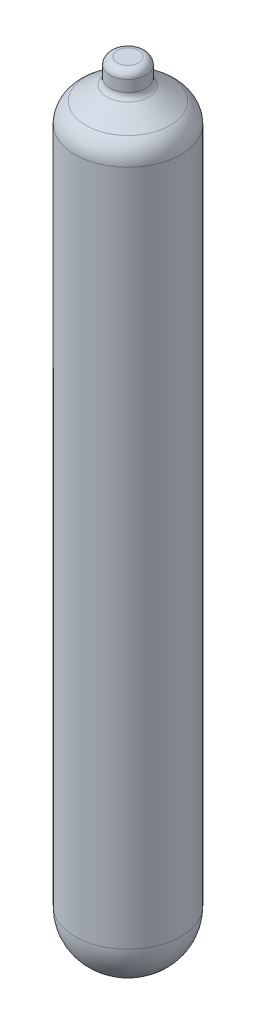
ISO-10303-21;
HEADER;
FILE_DESCRIPTION(('STEP AP214'),'2;1');
FILE_NAME('part.step','',(''),(''),'','','');
FILE_SCHEMA(('AUTOMOTIVE_DESIGN { 1 0 10303 214 1 1 1 1 }'));
ENDSEC;
DATA;
#1=APPLICATION_CONTEXT('core data for automotive mechanical design processes');
#2=APPLICATION_PROTOCOL_DEFINITION('international standard','automotive_design',2000,#1);
#3=PRODUCT_CONTEXT('',#1,'mechanical');
#4=PRODUCT('Part','Part','',(#3));
#5=PRODUCT_RELATED_PRODUCT_CATEGORY('part','',(#4));
#6=PRODUCT_DEFINITION_FORMATION('','',#4);
#7=PRODUCT_DEFINITION_CONTEXT('part definition',#1,'design');
#8=PRODUCT_DEFINITION('design','',#6,#7);
#9=PRODUCT_DEFINITION_SHAPE('','',#8);
#10=(LENGTH_UNIT() NAMED_UNIT(*) SI_UNIT(.MILLI.,.METRE.));
#11=(NAMED_UNIT(*) PLANE_ANGLE_UNIT() SI_UNIT($,.RADIAN.));
#12=(NAMED_UNIT(*) SI_UNIT($,.STERADIAN.) SOLID_ANGLE_UNIT());
#13=UNCERTAINTY_MEASURE_WITH_UNIT(LENGTH_MEASURE(1.E-05),#10,'distance_accuracy_value','');
#14=(GEOMETRIC_REPRESENTATION_CONTEXT(3) GLOBAL_UNCERTAINTY_ASSIGNED_CONTEXT((#13)) GLOBAL_UNIT_ASSIGNED_CONTEXT((#10,
#11,#12)) REPRESENTATION_CONTEXT('',''));
#15=CARTESIAN_POINT('',(0.,0.,0.));
#16=DIRECTION('',(0.,0.,1.));
#17=DIRECTION('',(1.,0.,0.));
#18=AXIS2_PLACEMENT_3D('',#15,#16,#17);
#19=CARTESIAN_POINT('',(0.,0.,0.));
#20=DIRECTION('',(0.,1.,0.));
#21=DIRECTION('',(-1.,0.,0.));
#22=AXIS2_PLACEMENT_3D('',#19,#20,#21);
#23=PLANE('',#22);
#24=CARTESIAN_POINT('',(0.,0.,0.));
#25=DIRECTION('',(0.,1.,0.));
#26=DIRECTION('',(-1.,0.,0.));
#27=AXIS2_PLACEMENT_3D('',#24,#25,#26);
#28=CIRCLE('',#27,9.99999999999997);
#29=CARTESIAN_POINT('',(-9.99999999999998,0.,0.));
#30=VERTEX_POINT('',#29);
#31=EDGE_CURVE('E10',#30,#30,#28,.T.);
#32=ORIENTED_EDGE('',*,*,#31,.F.);
#33=EDGE_LOOP('',(#32));
#34=FACE_BOUND('',#33,.T.);
#35=ADVANCED_FACE('F35',(#34),#23,.F.);
#36=CARTESIAN_POINT('',(0.,100.,0.));
#37=DIRECTION('',(0.,1.,0.));
#38=DIRECTION('',(-1.,0.,0.));
#39=AXIS2_PLACEMENT_3D('',#36,#37,#38);
#40=DEGENERATE_TOROIDAL_SURFACE('',#39,9.99999999999998,100.,.T.);
#41=CARTESIAN_POINT('',(0.,100.,0.));
#42=DIRECTION('',(0.,1.,0.));
#43=DIRECTION('',(-1.,0.,0.));
#44=AXIS2_PLACEMENT_3D('',#41,#42,#43);
#45=CIRCLE('',#44,110.);
#46=CARTESIAN_POINT('',(-110.,100.,0.));
#47=VERTEX_POINT('',#46);
#48=EDGE_CURVE('E41',#47,#47,#45,.T.);
#49=ORIENTED_EDGE('',*,*,#48,.F.);
#50=EDGE_LOOP('',(#49));
#51=FACE_BOUND('',#50,.T.);
#52=ORIENTED_EDGE('',*,*,#31,.T.);
#53=EDGE_LOOP('',(#52));
#54=FACE_BOUND('',#53,.T.);
#55=ADVANCED_FACE('F101',(#51,#54),#40,.T.);
#56=CARTESIAN_POINT('',(-1.65757355148003E-13,1553.07586737624,0.));
#57=DIRECTION('',(0.,1.,0.));
#58=DIRECTION('',(-1.,0.,0.));
#59=AXIS2_PLACEMENT_3D('',#56,#57,#58);
#60=CYLINDRICAL_SURFACE('',#59,110.);
#61=CARTESIAN_POINT('',(-1.61291133433256E-13,1507.61738437206,0.));
#62=DIRECTION('',(0.,1.,0.));
#63=DIRECTION('',(-1.,0.,0.));
#64=AXIS2_PLACEMENT_3D('',#61,#62,#63);
#65=CIRCLE('',#64,110.);
#66=CARTESIAN_POINT('',(-110.,1507.61738437206,0.));
#67=VERTEX_POINT('',#66);
#68=EDGE_CURVE('E45',#67,#67,#65,.T.);
#69=ORIENTED_EDGE('',*,*,#68,.F.);
#70=EDGE_LOOP('',(#69));
#71=FACE_BOUND('',#70,.T.);
#72=ORIENTED_EDGE('',*,*,#48,.T.);
#73=EDGE_LOOP('',(#72));
#74=FACE_BOUND('',#73,.T.);
#75=ADVANCED_FACE('F96',(#71,#74),#60,.T.);
#76=CARTESIAN_POINT('',(-1.59594559789866E-13,1507.61738437206,0.));
#77=DIRECTION('',(0.,1.,0.));
#78=DIRECTION('',(-1.,0.,0.));
#79=AXIS2_PLACEMENT_3D('',#76,#77,#78);
#80=TOROIDAL_SURFACE('',#79,60.0000000000001,50.);
#81=CARTESIAN_POINT('',(-1.6537704885772E-13,1549.20500109654,0.));
#82=DIRECTION('',(0.,1.,0.));
#83=DIRECTION('',(-1.,0.,0.));
#84=AXIS2_PLACEMENT_3D('',#81,#82,#83);
#85=CIRCLE('',#84,87.7573438062266);
#86=CARTESIAN_POINT('',(-87.7573438062267,1549.20500109654,0.));
#87=VERTEX_POINT('',#86);
#88=EDGE_CURVE('E49',#87,#87,#85,.T.);
#89=ORIENTED_EDGE('',*,*,#88,.F.);
#90=EDGE_LOOP('',(#89));
#91=FACE_BOUND('',#90,.T.);
#92=ORIENTED_EDGE('',*,*,#68,.T.);
#93=EDGE_LOOP('',(#92));
#94=FACE_BOUND('',#93,.T.);
#95=ADVANCED_FACE('F90',(#91,#94),#80,.T.);
#96=CARTESIAN_POINT('',(-1.6537704885772E-13,1549.20500109654,0.));
#97=DIRECTION('',(0.,-1.,0.));
#98=DIRECTION('',(1.,0.,0.));
#99=AXIS2_PLACEMENT_3D('',#96,#97,#98);
#100=CONICAL_SURFACE('',#99,87.7573438062266,0.982256784693646);
#101=CARTESIAN_POINT('',(-1.68248961080224E-13,1578.4361457406,0.));
#102=DIRECTION('',(0.,1.,0.));
#103=DIRECTION('',(-1.,0.,0.));
#104=AXIS2_PLACEMENT_3D('',#101,#102,#103);
#105=CIRCLE('',#104,43.9615956121098);
#106=CARTESIAN_POINT('',(-43.96159561211,1578.4361457406,0.));
#107=VERTEX_POINT('',#106);
#108=EDGE_CURVE('E54',#107,#107,#105,.T.);
#109=ORIENTED_EDGE('',*,*,#108,.F.);
#110=EDGE_LOOP('',(#109));
#111=FACE_BOUND('',#110,.T.);
#112=ORIENTED_EDGE('',*,*,#88,.T.);
#113=EDGE_LOOP('',(#112));
#114=FACE_BOUND('',#113,.T.);
#115=ADVANCED_FACE('F84',(#111,#114),#100,.T.);
#116=CARTESIAN_POINT('',(-1.73472347597681E-13,1590.91243075795,0.));
#117=DIRECTION('',(0.,1.,0.));
#118=DIRECTION('',(-1.,0.,0.));
#119=AXIS2_PLACEMENT_3D('',#116,#117,#118);
#120=TOROIDAL_SURFACE('',#119,52.2887987539778,14.9999999999999);
#121=CARTESIAN_POINT('',(-1.69474735707563E-13,1590.91243075795,0.));
#122=DIRECTION('',(0.,1.,0.));
#123=DIRECTION('',(-1.,0.,0.));
#124=AXIS2_PLACEMENT_3D('',#121,#122,#123);
#125=CIRCLE('',#124,37.2887987539778);
#126=CARTESIAN_POINT('',(-37.288798753978,1590.91243075795,0.));
#127=VERTEX_POINT('',#126);
#128=EDGE_CURVE('E57',#127,#127,#125,.T.);
#129=ORIENTED_EDGE('',*,*,#128,.F.);
#130=EDGE_LOOP('',(#129));
#131=FACE_BOUND('',#130,.T.);
#132=ORIENTED_EDGE('',*,*,#108,.T.);
#133=EDGE_LOOP('',(#132));
#134=FACE_BOUND('',#133,.T.);
#135=ADVANCED_FACE('F78',(#131,#134),#120,.F.);
#136=CARTESIAN_POINT('',(-1.65757355148003E-13,1553.07586737624,0.));
#137=DIRECTION('',(0.,1.,0.));
#138=DIRECTION('',(-1.,0.,0.));
#139=AXIS2_PLACEMENT_3D('',#136,#137,#138);
#140=CYLINDRICAL_SURFACE('',#139,37.2887987539778);
#141=CARTESIAN_POINT('',(-1.71758649755223E-13,1614.15876167245,0.));
#142=DIRECTION('',(0.,1.,0.));
#143=DIRECTION('',(-1.,0.,0.));
#144=AXIS2_PLACEMENT_3D('',#141,#142,#143);
#145=CIRCLE('',#144,37.2887987539778);
#146=CARTESIAN_POINT('',(-37.2887987539779,1614.15876167245,0.));
#147=VERTEX_POINT('',#146);
#148=EDGE_CURVE('E60',#147,#147,#145,.T.);
#149=ORIENTED_EDGE('',*,*,#148,.F.);
#150=EDGE_LOOP('',(#149));
#151=FACE_BOUND('',#150,.T.);
#152=ORIENTED_EDGE('',*,*,#128,.T.);
#153=EDGE_LOOP('',(#152));
#154=FACE_BOUND('',#153,.T.);
#155=ADVANCED_FACE('F72',(#151,#154),#140,.T.);
#156=CARTESIAN_POINT('',(-1.73472347597681E-13,1614.15876167245,0.));
#157=DIRECTION('',(0.,1.,0.));
#158=DIRECTION('',(-1.,0.,0.));
#159=AXIS2_PLACEMENT_3D('',#156,#157,#158);
#160=TOROIDAL_SURFACE('',#159,22.2887987539778,15.);
#161=CARTESIAN_POINT('',(-1.73232375258009E-13,1629.15876167245,0.));
#162=DIRECTION('',(0.,1.,0.));
#163=DIRECTION('',(-1.,0.,0.));
#164=AXIS2_PLACEMENT_3D('',#161,#162,#163);
#165=CIRCLE('',#164,22.2887987539778);
#166=CARTESIAN_POINT('',(-22.2887987539779,1629.15876167245,0.));
#167=VERTEX_POINT('',#166);
#168=EDGE_CURVE('E63',#167,#167,#165,.T.);
#169=ORIENTED_EDGE('',*,*,#168,.F.);
#170=EDGE_LOOP('',(#169));
#171=FACE_BOUND('',#170,.T.);
#172=ORIENTED_EDGE('',*,*,#148,.T.);
#173=EDGE_LOOP('',(#172));
#174=FACE_BOUND('',#173,.T.);
#175=ADVANCED_FACE('F69',(#171,#174),#160,.T.);
#176=CARTESIAN_POINT('',(22.2887987539776,1629.15876167245,0.));
#177=DIRECTION('',(0.,-1.,0.));
#178=DIRECTION('',(1.,0.,0.));
#179=AXIS2_PLACEMENT_3D('',#176,#177,#178);
#180=PLANE('',#179);
#181=ORIENTED_EDGE('',*,*,#168,.T.);
#182=EDGE_LOOP('',(#181));
#183=FACE_BOUND('',#182,.T.);
#184=ADVANCED_FACE('F67',(#183),#180,.F.);
#185=CLOSED_SHELL('',(#35,#55,#75,#95,#115,#135,#155,#175,#184));
#186=MANIFOLD_SOLID_BREP('B2',#185);
#187=ADVANCED_BREP_SHAPE_REPRESENTATION('',(#18,#186),#14);
#188=SHAPE_DEFINITION_REPRESENTATION(#9,#187);
ENDSEC;
END-ISO-10303-21;
